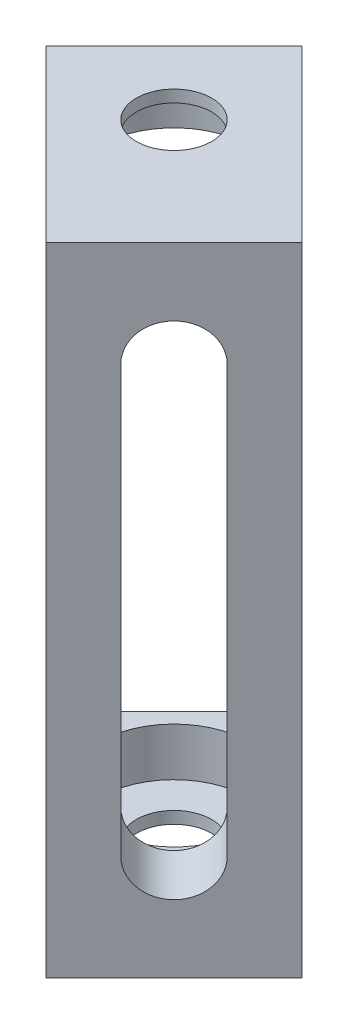
ISO-10303-21;
HEADER;
FILE_DESCRIPTION(('STEP AP214'),'2;1');
FILE_NAME('part.step','',(''),(''),'','','');
FILE_SCHEMA(('AUTOMOTIVE_DESIGN { 1 0 10303 214 1 1 1 1 }'));
ENDSEC;
DATA;
#1=APPLICATION_CONTEXT('core data for automotive mechanical design processes');
#2=APPLICATION_PROTOCOL_DEFINITION('international standard','automotive_design',2000,#1);
#3=PRODUCT_CONTEXT('',#1,'mechanical');
#4=PRODUCT('Part','Part','',(#3));
#5=PRODUCT_RELATED_PRODUCT_CATEGORY('part','',(#4));
#6=PRODUCT_DEFINITION_FORMATION('','',#4);
#7=PRODUCT_DEFINITION_CONTEXT('part definition',#1,'design');
#8=PRODUCT_DEFINITION('design','',#6,#7);
#9=PRODUCT_DEFINITION_SHAPE('','',#8);
#10=(LENGTH_UNIT() NAMED_UNIT(*) SI_UNIT(.MILLI.,.METRE.));
#11=(NAMED_UNIT(*) PLANE_ANGLE_UNIT() SI_UNIT($,.RADIAN.));
#12=(NAMED_UNIT(*) SI_UNIT($,.STERADIAN.) SOLID_ANGLE_UNIT());
#13=UNCERTAINTY_MEASURE_WITH_UNIT(LENGTH_MEASURE(1.E-05),#10,'distance_accuracy_value','');
#14=(GEOMETRIC_REPRESENTATION_CONTEXT(3) GLOBAL_UNCERTAINTY_ASSIGNED_CONTEXT((#13)) GLOBAL_UNIT_ASSIGNED_CONTEXT((#10,
#11,#12)) REPRESENTATION_CONTEXT('',''));
#15=CARTESIAN_POINT('',(0.,0.,0.));
#16=DIRECTION('',(0.,0.,1.));
#17=DIRECTION('',(1.,0.,0.));
#18=AXIS2_PLACEMENT_3D('',#15,#16,#17);
#19=CARTESIAN_POINT('',(-69.5647521950416,1.79036789554588E-13,-69.564752195041));
#20=DIRECTION('',(-0.707106781186551,0.,-0.707106781186544));
#21=DIRECTION('',(-0.707106781186544,0.,0.707106781186551));
#22=AXIS2_PLACEMENT_3D('',#19,#20,#21);
#23=PLANE('',#22);
#24=CARTESIAN_POINT('',(-80.7580787532979,22.4091567481048,-58.3714256367845));
#25=DIRECTION('',(0.70710678118655,0.,0.707106781186545));
#26=DIRECTION('',(0.707106781186545,0.,-0.70710678118655));
#27=AXIS2_PLACEMENT_3D('',#24,#25,#26);
#28=CIRCLE('',#27,1.5875);
#29=CARTESIAN_POINT('',(-79.6355467381643,22.4091567481048,-59.4939576519182));
#30=VERTEX_POINT('',#29);
#31=CARTESIAN_POINT('',(-81.8806107684316,22.4091567481048,-57.2488936216509));
#32=VERTEX_POINT('',#31);
#33=EDGE_CURVE('E211',#30,#32,#28,.T.);
#34=ORIENTED_EDGE('',*,*,#33,.T.);
#35=DIRECTION('',(0.,-1.,0.));
#36=VECTOR('',#35,1.);
#37=CARTESIAN_POINT('',(-81.8806107684316,22.4091567481048,-57.2488936216509));
#38=LINE('',#37,#36);
#39=CARTESIAN_POINT('',(-81.8806107684316,4.44499999999941,-57.2488936216509));
#40=VERTEX_POINT('',#39);
#41=EDGE_CURVE('E214',#32,#40,#38,.T.);
#42=ORIENTED_EDGE('',*,*,#41,.T.);
#43=CARTESIAN_POINT('',(-80.758078753298,4.44499999999942,-58.3714256367845));
#44=DIRECTION('',(0.70710678118655,0.,0.707106781186545));
#45=DIRECTION('',(0.707106781186545,0.,-0.70710678118655));
#46=AXIS2_PLACEMENT_3D('',#43,#44,#45);
#47=CIRCLE('',#46,1.5875);
#48=CARTESIAN_POINT('',(-79.6355467381643,4.44499999999942,-59.4939576519182));
#49=VERTEX_POINT('',#48);
#50=EDGE_CURVE('E55',#40,#49,#47,.T.);
#51=ORIENTED_EDGE('',*,*,#50,.T.);
#52=DIRECTION('',(0.,1.,0.));
#53=VECTOR('',#52,1.);
#54=CARTESIAN_POINT('',(-79.6355467381643,22.4091567481048,-59.4939576519182));
#55=LINE('',#54,#53);
#56=EDGE_CURVE('E219',#49,#30,#55,.T.);
#57=ORIENTED_EDGE('',*,*,#56,.T.);
#58=EDGE_LOOP('',(#34,#42,#51,#57));
#59=FACE_BOUND('',#58,.T.);
#60=DIRECTION('',(0.,1.,0.));
#61=VECTOR('',#60,1.);
#62=CARTESIAN_POINT('',(-78.0640019169772,-5.77204021468408E-13,-61.0655024731053));
#63=LINE('',#62,#61);
#64=CARTESIAN_POINT('',(-78.0640019169774,2.53999999999945,-61.0655024731051));
#65=VERTEX_POINT('',#64);
#66=CARTESIAN_POINT('',(-78.0640019169772,24.3141567481049,-61.0655024731052));
#67=VERTEX_POINT('',#66);
#68=EDGE_CURVE('E147',#65,#67,#63,.T.);
#69=ORIENTED_EDGE('',*,*,#68,.F.);
#70=DIRECTION('',(0.707106781186544,0.,-0.707106781186551));
#71=VECTOR('',#70,1.);
#72=CARTESIAN_POINT('',(-78.0640019169774,2.53999999999945,-61.0655024731051));
#73=LINE('',#72,#71);
#74=CARTESIAN_POINT('',(-83.4521555896189,2.53999999999946,-55.6773488004636));
#75=VERTEX_POINT('',#74);
#76=EDGE_CURVE('E128',#75,#65,#73,.T.);
#77=ORIENTED_EDGE('',*,*,#76,.F.);
#78=DIRECTION('',(0.,-1.,0.));
#79=VECTOR('',#78,1.);
#80=CARTESIAN_POINT('',(-83.4521555896187,-5.8208514288112E-13,-55.6773488004638));
#81=LINE('',#80,#79);
#82=CARTESIAN_POINT('',(-83.4521555896187,24.3141567481049,-55.6773488004637));
#83=VERTEX_POINT('',#82);
#84=EDGE_CURVE('E153',#83,#75,#81,.T.);
#85=ORIENTED_EDGE('',*,*,#84,.F.);
#86=DIRECTION('',(-0.707106781186544,0.,0.707106781186551));
#87=VECTOR('',#86,1.);
#88=CARTESIAN_POINT('',(-78.0640019169772,24.3141567481049,-61.0655024731052));
#89=LINE('',#88,#87);
#90=EDGE_CURVE('E140',#67,#83,#89,.T.);
#91=ORIENTED_EDGE('',*,*,#90,.F.);
#92=EDGE_LOOP('',(#69,#77,#85,#91));
#93=FACE_BOUND('',#92,.T.);
#94=ADVANCED_FACE('F38',(#59,#93),#23,.T.);
#95=CARTESIAN_POINT('',(-83.4521555896187,-5.8208514288112E-13,-55.6773488004638));
#96=DIRECTION('',(-0.707106781186545,0.,0.70710678118655));
#97=DIRECTION('',(0.70710678118655,0.,0.707106781186545));
#98=AXIS2_PLACEMENT_3D('',#95,#96,#97);
#99=PLANE('',#98);
#100=DIRECTION('',(0.,-1.,0.));
#101=VECTOR('',#100,1.);
#102=CARTESIAN_POINT('',(-81.6561043654049,-5.86013166052507E-13,-53.88129757625));
#103=LINE('',#102,#101);
#104=CARTESIAN_POINT('',(-81.6561043654048,26.8541567481048,-53.8812975762499));
#105=VERTEX_POINT('',#104);
#106=CARTESIAN_POINT('',(-81.6561043654049,-5.86013166052507E-13,-53.88129757625));
#107=VERTEX_POINT('',#106);
#108=EDGE_CURVE('E160',#105,#107,#103,.T.);
#109=ORIENTED_EDGE('',*,*,#108,.F.);
#110=DIRECTION('',(0.70710678118655,0.,0.707106781186545));
#111=VECTOR('',#110,1.);
#112=CARTESIAN_POINT('',(-83.4521555896187,26.8541567481048,-55.6773488004638));
#113=LINE('',#112,#111);
#114=CARTESIAN_POINT('',(-88.8403092622602,26.8541567481049,-61.0655024731052));
#115=VERTEX_POINT('',#114);
#116=EDGE_CURVE('E11',#115,#105,#113,.T.);
#117=ORIENTED_EDGE('',*,*,#116,.F.);
#118=DIRECTION('',(0.,1.,0.));
#119=VECTOR('',#118,1.);
#120=CARTESIAN_POINT('',(-88.8403092622602,26.8541567481049,-61.0655024731052));
#121=LINE('',#120,#119);
#122=CARTESIAN_POINT('',(-88.8403092622602,24.3141567481049,-61.0655024731052));
#123=VERTEX_POINT('',#122);
#124=EDGE_CURVE('E200',#123,#115,#121,.T.);
#125=ORIENTED_EDGE('',*,*,#124,.F.);
#126=DIRECTION('',(0.707106781186551,0.,0.707106781186544));
#127=VECTOR('',#126,1.);
#128=CARTESIAN_POINT('',(-88.8403092622602,24.3141567481049,-61.0655024731052));
#129=LINE('',#128,#127);
#130=EDGE_CURVE('E205',#123,#83,#129,.T.);
#131=ORIENTED_EDGE('',*,*,#130,.T.);
#132=ORIENTED_EDGE('',*,*,#84,.T.);
#133=DIRECTION('',(0.707106781186551,0.,0.707106781186544));
#134=VECTOR('',#133,1.);
#135=CARTESIAN_POINT('',(-88.8403092622604,2.53999999999947,-61.0655024731051));
#136=LINE('',#135,#134);
#137=CARTESIAN_POINT('',(-88.8403092622604,2.53999999999947,-61.0655024731051));
#138=VERTEX_POINT('',#137);
#139=EDGE_CURVE('E135',#138,#75,#136,.T.);
#140=ORIENTED_EDGE('',*,*,#139,.F.);
#141=DIRECTION('',(0.,1.,0.));
#142=VECTOR('',#141,1.);
#143=CARTESIAN_POINT('',(-88.8403092622604,-5.24110931639945E-13,-61.0655024731051));
#144=LINE('',#143,#142);
#145=CARTESIAN_POINT('',(-88.8403092622604,-5.24110931639945E-13,-61.0655024731051));
#146=VERTEX_POINT('',#145);
#147=EDGE_CURVE('E187',#146,#138,#144,.T.);
#148=ORIENTED_EDGE('',*,*,#147,.F.);
#149=DIRECTION('',(0.70710678118655,0.,0.707106781186545));
#150=VECTOR('',#149,1.);
#151=CARTESIAN_POINT('',(-83.4521555896187,-5.8208514288112E-13,-55.6773488004638));
#152=LINE('',#151,#150);
#153=EDGE_CURVE('E42',#146,#107,#152,.T.);
#154=ORIENTED_EDGE('',*,*,#153,.T.);
#155=EDGE_LOOP('',(#109,#117,#125,#131,#132,#140,#148,#154));
#156=FACE_BOUND('',#155,.T.);
#157=ADVANCED_FACE('F40',(#156),#99,.T.);
#158=CARTESIAN_POINT('',(-83.4521555896187,26.8541567481048,-55.6773488004638));
#159=DIRECTION('',(0.,1.,0.));
#160=DIRECTION('',(0.,0.,1.));
#161=AXIS2_PLACEMENT_3D('',#158,#159,#160);
#162=PLANE('',#161);
#163=CARTESIAN_POINT('',(-83.4521555896187,26.8541567481049,-61.0655024731052));
#164=DIRECTION('',(0.,-1.,0.));
#165=DIRECTION('',(0.,0.,-1.));
#166=AXIS2_PLACEMENT_3D('',#163,#164,#165);
#167=CIRCLE('',#166,1.58750000000001);
#168=CARTESIAN_POINT('',(-83.4521555896187,26.8541567481049,-62.6530024731052));
#169=VERTEX_POINT('',#168);
#170=EDGE_CURVE('E295',#169,#169,#167,.T.);
#171=ORIENTED_EDGE('',*,*,#170,.T.);
#172=EDGE_LOOP('',(#171));
#173=FACE_BOUND('',#172,.T.);
#174=DIRECTION('',(-0.707106781186544,0.,0.707106781186551));
#175=VECTOR('',#174,1.);
#176=CARTESIAN_POINT('',(-81.6561043654048,26.8541567481048,-53.8812975762499));
#177=LINE('',#176,#175);
#178=CARTESIAN_POINT('',(-76.2679506927634,26.8541567481048,-59.2694512488914));
#179=VERTEX_POINT('',#178);
#180=EDGE_CURVE('E156',#179,#105,#177,.T.);
#181=ORIENTED_EDGE('',*,*,#180,.F.);
#182=DIRECTION('',(0.70710678118655,0.,0.707106781186545));
#183=VECTOR('',#182,1.);
#184=CARTESIAN_POINT('',(-78.0640019169772,26.8541567481048,-61.0655024731053));
#185=LINE('',#184,#183);
#186=CARTESIAN_POINT('',(-83.4521555896187,26.8541567481049,-66.4536561457467));
#187=VERTEX_POINT('',#186);
#188=EDGE_CURVE('E47',#187,#179,#185,.T.);
#189=ORIENTED_EDGE('',*,*,#188,.F.);
#190=DIRECTION('',(0.707106781186545,0.,-0.70710678118655));
#191=VECTOR('',#190,1.);
#192=CARTESIAN_POINT('',(-83.4521555896187,26.8541567481049,-66.4536561457467));
#193=LINE('',#192,#191);
#194=EDGE_CURVE('E202',#115,#187,#193,.T.);
#195=ORIENTED_EDGE('',*,*,#194,.F.);
#196=ORIENTED_EDGE('',*,*,#116,.T.);
#197=EDGE_LOOP('',(#181,#189,#195,#196));
#198=FACE_BOUND('',#197,.T.);
#199=ADVANCED_FACE('F264',(#173,#198),#162,.T.);
#200=CARTESIAN_POINT('',(-78.0640019169772,-5.77204021468408E-13,-61.0655024731053));
#201=DIRECTION('',(0.707106781186545,0.,-0.70710678118655));
#202=DIRECTION('',(-0.70710678118655,0.,-0.707106781186545));
#203=AXIS2_PLACEMENT_3D('',#200,#201,#202);
#204=PLANE('',#203);
#205=DIRECTION('',(0.,1.,0.));
#206=VECTOR('',#205,1.);
#207=CARTESIAN_POINT('',(-76.2679506927634,-5.81132044639795E-13,-59.2694512488915));
#208=LINE('',#207,#206);
#209=CARTESIAN_POINT('',(-76.2679506927634,-5.81132044639795E-13,-59.2694512488915));
#210=VERTEX_POINT('',#209);
#211=EDGE_CURVE('E167',#210,#179,#208,.T.);
#212=ORIENTED_EDGE('',*,*,#211,.F.);
#213=DIRECTION('',(0.70710678118655,0.,0.707106781186545));
#214=VECTOR('',#213,1.);
#215=CARTESIAN_POINT('',(-78.0640019169772,-5.77204021468408E-13,-61.0655024731053));
#216=LINE('',#215,#214);
#217=CARTESIAN_POINT('',(-83.4521555896187,-5.0753201776221E-13,-66.4536561457468));
#218=VERTEX_POINT('',#217);
#219=EDGE_CURVE('E155',#218,#210,#216,.T.);
#220=ORIENTED_EDGE('',*,*,#219,.F.);
#221=DIRECTION('',(0.,-1.,0.));
#222=VECTOR('',#221,1.);
#223=CARTESIAN_POINT('',(-83.4521555896187,-5.0753201776221E-13,-66.4536561457468));
#224=LINE('',#223,#222);
#225=CARTESIAN_POINT('',(-83.4521555896189,2.53999999999946,-66.4536561457466));
#226=VERTEX_POINT('',#225);
#227=EDGE_CURVE('E141',#226,#218,#224,.T.);
#228=ORIENTED_EDGE('',*,*,#227,.F.);
#229=DIRECTION('',(0.707106781186551,0.,0.707106781186544));
#230=VECTOR('',#229,1.);
#231=CARTESIAN_POINT('',(-83.4521555896189,2.53999999999946,-66.4536561457466));
#232=LINE('',#231,#230);
#233=EDGE_CURVE('E132',#226,#65,#232,.T.);
#234=ORIENTED_EDGE('',*,*,#233,.T.);
#235=ORIENTED_EDGE('',*,*,#68,.T.);
#236=DIRECTION('',(0.707106781186551,0.,0.707106781186544));
#237=VECTOR('',#236,1.);
#238=CARTESIAN_POINT('',(-83.4521555896187,24.3141567481049,-66.4536561457467));
#239=LINE('',#238,#237);
#240=CARTESIAN_POINT('',(-83.4521555896187,24.3141567481049,-66.4536561457467));
#241=VERTEX_POINT('',#240);
#242=EDGE_CURVE('E209',#241,#67,#239,.T.);
#243=ORIENTED_EDGE('',*,*,#242,.F.);
#244=DIRECTION('',(0.,-1.,0.));
#245=VECTOR('',#244,1.);
#246=CARTESIAN_POINT('',(-83.4521555896187,26.8541567481049,-66.4536561457467));
#247=LINE('',#246,#245);
#248=EDGE_CURVE('E195',#187,#241,#247,.T.);
#249=ORIENTED_EDGE('',*,*,#248,.F.);
#250=ORIENTED_EDGE('',*,*,#188,.T.);
#251=EDGE_LOOP('',(#212,#220,#228,#234,#235,#243,#249,#250));
#252=FACE_BOUND('',#251,.T.);
#253=ADVANCED_FACE('F145',(#252),#204,.T.);
#254=CARTESIAN_POINT('',(-83.4521555896187,-5.8208514288112E-13,-55.6773488004638));
#255=DIRECTION('',(0.,-1.,0.));
#256=DIRECTION('',(0.,0.,-1.));
#257=AXIS2_PLACEMENT_3D('',#254,#255,#256);
#258=PLANE('',#257);
#259=CARTESIAN_POINT('',(-83.4521555896189,-5.99346960949987E-13,-61.0655024731051));
#260=DIRECTION('',(0.,1.,0.));
#261=DIRECTION('',(0.,0.,1.));
#262=AXIS2_PLACEMENT_3D('',#259,#260,#261);
#263=CIRCLE('',#262,1.58750000000001);
#264=CARTESIAN_POINT('',(-83.4521555896189,-5.99672990769984E-13,-59.4780024731051));
#265=VERTEX_POINT('',#264);
#266=EDGE_CURVE('E281',#265,#265,#263,.T.);
#267=ORIENTED_EDGE('',*,*,#266,.T.);
#268=EDGE_LOOP('',(#267));
#269=FACE_BOUND('',#268,.T.);
#270=DIRECTION('',(0.707106781186545,0.,-0.70710678118655));
#271=VECTOR('',#270,1.);
#272=CARTESIAN_POINT('',(-81.6561043654049,-5.86013166052507E-13,-53.88129757625));
#273=LINE('',#272,#271);
#274=EDGE_CURVE('E163',#107,#210,#273,.T.);
#275=ORIENTED_EDGE('',*,*,#274,.F.);
#276=ORIENTED_EDGE('',*,*,#153,.F.);
#277=DIRECTION('',(-0.707106781186543,0.,0.707106781186552));
#278=VECTOR('',#277,1.);
#279=CARTESIAN_POINT('',(-83.4521555896187,-5.0753201776221E-13,-66.4536561457468));
#280=LINE('',#279,#278);
#281=EDGE_CURVE('E177',#218,#146,#280,.T.);
#282=ORIENTED_EDGE('',*,*,#281,.F.);
#283=ORIENTED_EDGE('',*,*,#219,.T.);
#284=EDGE_LOOP('',(#275,#276,#282,#283));
#285=FACE_BOUND('',#284,.T.);
#286=ADVANCED_FACE('F175',(#269,#285),#258,.T.);
#287=CARTESIAN_POINT('',(-67.7687009708278,1.75108766383202E-13,-67.7687009708272));
#288=DIRECTION('',(-0.707106781186551,0.,-0.707106781186544));
#289=DIRECTION('',(-0.707106781186544,0.,0.707106781186551));
#290=AXIS2_PLACEMENT_3D('',#287,#288,#289);
#291=PLANE('',#290);
#292=DIRECTION('',(0.,-1.,0.));
#293=VECTOR('',#292,1.);
#294=CARTESIAN_POINT('',(-80.0845595442178,22.4091567481048,-55.4528423974371));
#295=LINE('',#294,#293);
#296=CARTESIAN_POINT('',(-80.0845595442178,22.4091567481048,-55.4528423974371));
#297=VERTEX_POINT('',#296);
#298=CARTESIAN_POINT('',(-80.0845595442178,4.44499999999941,-55.4528423974371));
#299=VERTEX_POINT('',#298);
#300=EDGE_CURVE('E224',#297,#299,#295,.T.);
#301=ORIENTED_EDGE('',*,*,#300,.F.);
#302=CARTESIAN_POINT('',(-78.9620275290841,22.4091567481048,-56.5753744125707));
#303=DIRECTION('',(0.70710678118655,0.,0.707106781186545));
#304=DIRECTION('',(0.707106781186545,0.,-0.70710678118655));
#305=AXIS2_PLACEMENT_3D('',#302,#303,#304);
#306=CIRCLE('',#305,1.5875);
#307=CARTESIAN_POINT('',(-77.8394955139505,22.4091567481048,-57.6979064277043));
#308=VERTEX_POINT('',#307);
#309=EDGE_CURVE('E63',#308,#297,#306,.T.);
#310=ORIENTED_EDGE('',*,*,#309,.F.);
#311=DIRECTION('',(0.,1.,0.));
#312=VECTOR('',#311,1.);
#313=CARTESIAN_POINT('',(-77.8394955139505,22.4091567481048,-57.6979064277043));
#314=LINE('',#313,#312);
#315=CARTESIAN_POINT('',(-77.8394955139505,4.44499999999942,-57.6979064277044));
#316=VERTEX_POINT('',#315);
#317=EDGE_CURVE('E215',#316,#308,#314,.T.);
#318=ORIENTED_EDGE('',*,*,#317,.F.);
#319=CARTESIAN_POINT('',(-78.9620275290841,4.44499999999942,-56.5753744125707));
#320=DIRECTION('',(0.70710678118655,0.,0.707106781186545));
#321=DIRECTION('',(0.707106781186545,0.,-0.70710678118655));
#322=AXIS2_PLACEMENT_3D('',#319,#320,#321);
#323=CIRCLE('',#322,1.5875);
#324=EDGE_CURVE('E227',#299,#316,#323,.T.);
#325=ORIENTED_EDGE('',*,*,#324,.F.);
#326=EDGE_LOOP('',(#301,#310,#318,#325));
#327=FACE_BOUND('',#326,.T.);
#328=ORIENTED_EDGE('',*,*,#108,.T.);
#329=ORIENTED_EDGE('',*,*,#274,.T.);
#330=ORIENTED_EDGE('',*,*,#211,.T.);
#331=ORIENTED_EDGE('',*,*,#180,.T.);
#332=EDGE_LOOP('',(#328,#329,#330,#331));
#333=FACE_BOUND('',#332,.T.);
#334=ADVANCED_FACE('F181',(#327,#333),#291,.F.);
#335=CARTESIAN_POINT('',(-80.7580787532979,22.4091567481048,-58.3714256367845));
#336=DIRECTION('',(0.70710678118655,0.,0.707106781186545));
#337=DIRECTION('',(0.707106781186545,0.,-0.70710678118655));
#338=AXIS2_PLACEMENT_3D('',#335,#336,#337);
#339=CYLINDRICAL_SURFACE('',#338,1.5875);
#340=ORIENTED_EDGE('',*,*,#309,.T.);
#341=DIRECTION('',(0.70710678118655,0.,0.707106781186545));
#342=VECTOR('',#341,1.);
#343=CARTESIAN_POINT('',(-81.8806107684316,22.4091567481048,-57.2488936216509));
#344=LINE('',#343,#342);
#345=EDGE_CURVE('E222',#32,#297,#344,.T.);
#346=ORIENTED_EDGE('',*,*,#345,.F.);
#347=ORIENTED_EDGE('',*,*,#33,.F.);
#348=DIRECTION('',(0.70710678118655,0.,0.707106781186545));
#349=VECTOR('',#348,1.);
#350=CARTESIAN_POINT('',(-79.6355467381643,22.4091567481048,-59.4939576519182));
#351=LINE('',#350,#349);
#352=EDGE_CURVE('E164',#30,#308,#351,.T.);
#353=ORIENTED_EDGE('',*,*,#352,.T.);
#354=EDGE_LOOP('',(#340,#346,#347,#353));
#355=FACE_BOUND('',#354,.T.);
#356=ADVANCED_FACE('F247',(#355),#339,.F.);
#357=CARTESIAN_POINT('',(-79.6355467381643,22.4091567481048,-59.4939576519182));
#358=DIRECTION('',(0.707106781186545,0.,-0.70710678118655));
#359=DIRECTION('',(-0.70710678118655,0.,-0.707106781186545));
#360=AXIS2_PLACEMENT_3D('',#357,#358,#359);
#361=PLANE('',#360);
#362=ORIENTED_EDGE('',*,*,#317,.T.);
#363=ORIENTED_EDGE('',*,*,#352,.F.);
#364=ORIENTED_EDGE('',*,*,#56,.F.);
#365=DIRECTION('',(0.70710678118655,0.,0.707106781186545));
#366=VECTOR('',#365,1.);
#367=CARTESIAN_POINT('',(-79.6355467381643,4.44499999999942,-59.4939576519182));
#368=LINE('',#367,#366);
#369=EDGE_CURVE('E233',#49,#316,#368,.T.);
#370=ORIENTED_EDGE('',*,*,#369,.T.);
#371=EDGE_LOOP('',(#362,#363,#364,#370));
#372=FACE_BOUND('',#371,.T.);
#373=ADVANCED_FACE('F249',(#372),#361,.F.);
#374=CARTESIAN_POINT('',(-80.758078753298,4.44499999999942,-58.3714256367845));
#375=DIRECTION('',(0.70710678118655,0.,0.707106781186545));
#376=DIRECTION('',(0.707106781186545,0.,-0.70710678118655));
#377=AXIS2_PLACEMENT_3D('',#374,#375,#376);
#378=CYLINDRICAL_SURFACE('',#377,1.5875);
#379=ORIENTED_EDGE('',*,*,#324,.T.);
#380=ORIENTED_EDGE('',*,*,#369,.F.);
#381=ORIENTED_EDGE('',*,*,#50,.F.);
#382=DIRECTION('',(0.70710678118655,0.,0.707106781186545));
#383=VECTOR('',#382,1.);
#384=CARTESIAN_POINT('',(-81.8806107684316,4.44499999999942,-57.2488936216509));
#385=LINE('',#384,#383);
#386=EDGE_CURVE('E235',#40,#299,#385,.T.);
#387=ORIENTED_EDGE('',*,*,#386,.T.);
#388=EDGE_LOOP('',(#379,#380,#381,#387));
#389=FACE_BOUND('',#388,.T.);
#390=ADVANCED_FACE('F244',(#389),#378,.F.);
#391=CARTESIAN_POINT('',(-81.8806107684316,22.4091567481048,-57.2488936216509));
#392=DIRECTION('',(-0.707106781186545,0.,0.70710678118655));
#393=DIRECTION('',(0.70710678118655,0.,0.707106781186545));
#394=AXIS2_PLACEMENT_3D('',#391,#392,#393);
#395=PLANE('',#394);
#396=ORIENTED_EDGE('',*,*,#300,.T.);
#397=ORIENTED_EDGE('',*,*,#386,.F.);
#398=ORIENTED_EDGE('',*,*,#41,.F.);
#399=ORIENTED_EDGE('',*,*,#345,.T.);
#400=EDGE_LOOP('',(#396,#397,#398,#399));
#401=FACE_BOUND('',#400,.T.);
#402=ADVANCED_FACE('F239',(#401),#395,.F.);
#403=CARTESIAN_POINT('',(-83.4521555896187,24.3141567481049,-66.4536561457467));
#404=DIRECTION('',(0.,1.,0.));
#405=DIRECTION('',(-1.,0.,0.));
#406=AXIS2_PLACEMENT_3D('',#403,#404,#405);
#407=PLANE('',#406);
#408=CARTESIAN_POINT('',(-83.4521555896187,24.3141567481049,-61.0655024731052));
#409=DIRECTION('',(0.,-1.,0.));
#410=DIRECTION('',(0.,0.,-1.));
#411=AXIS2_PLACEMENT_3D('',#408,#409,#410);
#412=CIRCLE('',#411,3.175);
#413=CARTESIAN_POINT('',(-83.4521555896187,24.3141567481049,-64.2405024731052));
#414=VERTEX_POINT('',#413);
#415=EDGE_CURVE('E304',#414,#414,#412,.T.);
#416=ORIENTED_EDGE('',*,*,#415,.F.);
#417=EDGE_LOOP('',(#416));
#418=FACE_BOUND('',#417,.T.);
#419=ORIENTED_EDGE('',*,*,#90,.T.);
#420=ORIENTED_EDGE('',*,*,#130,.F.);
#421=DIRECTION('',(-0.707106781186544,0.,0.707106781186551));
#422=VECTOR('',#421,1.);
#423=CARTESIAN_POINT('',(-83.4521555896187,24.3141567481049,-66.4536561457467));
#424=LINE('',#423,#422);
#425=EDGE_CURVE('E198',#241,#123,#424,.T.);
#426=ORIENTED_EDGE('',*,*,#425,.F.);
#427=ORIENTED_EDGE('',*,*,#242,.T.);
#428=EDGE_LOOP('',(#419,#420,#426,#427));
#429=FACE_BOUND('',#428,.T.);
#430=ADVANCED_FACE('F310',(#418,#429),#407,.F.);
#431=CARTESIAN_POINT('',(-74.9529058676832,3.94003204697649E-13,-74.9529058676825));
#432=DIRECTION('',(-0.707106781186551,0.,-0.707106781186544));
#433=DIRECTION('',(-0.707106781186544,0.,0.707106781186551));
#434=AXIS2_PLACEMENT_3D('',#431,#432,#433);
#435=PLANE('',#434);
#436=ORIENTED_EDGE('',*,*,#248,.T.);
#437=ORIENTED_EDGE('',*,*,#425,.T.);
#438=ORIENTED_EDGE('',*,*,#124,.T.);
#439=ORIENTED_EDGE('',*,*,#194,.T.);
#440=EDGE_LOOP('',(#436,#437,#438,#439));
#441=FACE_BOUND('',#440,.T.);
#442=ADVANCED_FACE('F313',(#441),#435,.T.);
#443=CARTESIAN_POINT('',(-83.4521555896189,2.53999999999946,-66.4536561457466));
#444=DIRECTION('',(0.,-1.,0.));
#445=DIRECTION('',(1.,0.,0.));
#446=AXIS2_PLACEMENT_3D('',#443,#444,#445);
#447=PLANE('',#446);
#448=CARTESIAN_POINT('',(-83.4521555896189,2.53999999999946,-61.0655024731051));
#449=DIRECTION('',(0.,1.,0.));
#450=DIRECTION('',(0.,0.,1.));
#451=AXIS2_PLACEMENT_3D('',#448,#449,#450);
#452=CIRCLE('',#451,3.175);
#453=CARTESIAN_POINT('',(-83.4521555896189,2.53999999999946,-57.8905024731051));
#454=VERTEX_POINT('',#453);
#455=EDGE_CURVE('E292',#454,#454,#452,.T.);
#456=ORIENTED_EDGE('',*,*,#455,.F.);
#457=EDGE_LOOP('',(#456));
#458=FACE_BOUND('',#457,.T.);
#459=ORIENTED_EDGE('',*,*,#76,.T.);
#460=ORIENTED_EDGE('',*,*,#233,.F.);
#461=DIRECTION('',(0.707106781186544,0.,-0.707106781186551));
#462=VECTOR('',#461,1.);
#463=CARTESIAN_POINT('',(-83.4521555896189,2.53999999999946,-66.4536561457466));
#464=LINE('',#463,#462);
#465=EDGE_CURVE('E150',#138,#226,#464,.T.);
#466=ORIENTED_EDGE('',*,*,#465,.F.);
#467=ORIENTED_EDGE('',*,*,#139,.T.);
#468=EDGE_LOOP('',(#459,#460,#466,#467));
#469=FACE_BOUND('',#468,.T.);
#470=ADVANCED_FACE('F130',(#458,#469),#447,.F.);
#471=CARTESIAN_POINT('',(-74.9529058676831,3.94003204697598E-13,-74.9529058676825));
#472=DIRECTION('',(0.707106781186551,0.,0.707106781186544));
#473=DIRECTION('',(0.707106781186544,0.,-0.707106781186551));
#474=AXIS2_PLACEMENT_3D('',#471,#472,#473);
#475=PLANE('',#474);
#476=ORIENTED_EDGE('',*,*,#227,.T.);
#477=ORIENTED_EDGE('',*,*,#281,.T.);
#478=ORIENTED_EDGE('',*,*,#147,.T.);
#479=ORIENTED_EDGE('',*,*,#465,.T.);
#480=EDGE_LOOP('',(#476,#477,#478,#479));
#481=FACE_BOUND('',#480,.T.);
#482=ADVANCED_FACE('F189',(#481),#475,.F.);
#483=CARTESIAN_POINT('',(-83.4521555896189,2.53999999999946,-61.0655024731051));
#484=DIRECTION('',(0.,1.,0.));
#485=DIRECTION('',(0.,0.,1.));
#486=AXIS2_PLACEMENT_3D('',#483,#484,#485);
#487=CYLINDRICAL_SURFACE('',#486,1.58750000000001);
#488=ORIENTED_EDGE('',*,*,#266,.F.);
#489=EDGE_LOOP('',(#488));
#490=FACE_BOUND('',#489,.T.);
#491=CARTESIAN_POINT('',(-83.4521555896189,0.507999999999463,-61.0655024731051));
#492=DIRECTION('',(0.,1.,0.));
#493=DIRECTION('',(0.,0.,1.));
#494=AXIS2_PLACEMENT_3D('',#491,#492,#493);
#495=CIRCLE('',#494,1.58750000000002);
#496=CARTESIAN_POINT('',(-83.4521555896189,0.507999999999463,-59.4780024731051));
#497=VERTEX_POINT('',#496);
#498=EDGE_CURVE('E283',#497,#497,#495,.T.);
#499=ORIENTED_EDGE('',*,*,#498,.T.);
#500=EDGE_LOOP('',(#499));
#501=FACE_BOUND('',#500,.T.);
#502=ADVANCED_FACE('F328',(#490,#501),#487,.F.);
#503=CARTESIAN_POINT('',(-81.8646555896189,0.507999999999463,-61.0655024731051));
#504=DIRECTION('',(0.,-1.,0.));
#505=DIRECTION('',(0.,0.,-1.));
#506=AXIS2_PLACEMENT_3D('',#503,#504,#505);
#507=PLANE('',#506);
#508=ORIENTED_EDGE('',*,*,#498,.F.);
#509=EDGE_LOOP('',(#508));
#510=FACE_BOUND('',#509,.T.);
#511=CARTESIAN_POINT('',(-83.4521555896189,0.507999999999463,-61.0655024731051));
#512=DIRECTION('',(0.,1.,0.));
#513=DIRECTION('',(0.,0.,1.));
#514=AXIS2_PLACEMENT_3D('',#511,#512,#513);
#515=CIRCLE('',#514,3.175);
#516=CARTESIAN_POINT('',(-83.4521555896189,0.507999999999462,-57.8905024731051));
#517=VERTEX_POINT('',#516);
#518=EDGE_CURVE('E287',#517,#517,#515,.T.);
#519=ORIENTED_EDGE('',*,*,#518,.T.);
#520=EDGE_LOOP('',(#519));
#521=FACE_BOUND('',#520,.T.);
#522=ADVANCED_FACE('F332',(#510,#521),#507,.F.);
#523=CARTESIAN_POINT('',(-83.4521555896189,2.53999999999946,-61.0655024731051));
#524=DIRECTION('',(0.,1.,0.));
#525=DIRECTION('',(0.,0.,1.));
#526=AXIS2_PLACEMENT_3D('',#523,#524,#525);
#527=CYLINDRICAL_SURFACE('',#526,3.175);
#528=ORIENTED_EDGE('',*,*,#518,.F.);
#529=EDGE_LOOP('',(#528));
#530=FACE_BOUND('',#529,.T.);
#531=ORIENTED_EDGE('',*,*,#455,.T.);
#532=EDGE_LOOP('',(#531));
#533=FACE_BOUND('',#532,.T.);
#534=ADVANCED_FACE('F335',(#530,#533),#527,.F.);
#535=CARTESIAN_POINT('',(-83.4521555896187,24.3141567481049,-61.0655024731052));
#536=DIRECTION('',(0.,-1.,0.));
#537=DIRECTION('',(0.,0.,-1.));
#538=AXIS2_PLACEMENT_3D('',#535,#536,#537);
#539=CYLINDRICAL_SURFACE('',#538,1.58750000000001);
#540=ORIENTED_EDGE('',*,*,#170,.F.);
#541=EDGE_LOOP('',(#540));
#542=FACE_BOUND('',#541,.T.);
#543=CARTESIAN_POINT('',(-83.4521555896187,26.3461567481049,-61.0655024731052));
#544=DIRECTION('',(0.,-1.,0.));
#545=DIRECTION('',(0.,0.,-1.));
#546=AXIS2_PLACEMENT_3D('',#543,#544,#545);
#547=CIRCLE('',#546,1.58750000000002);
#548=CARTESIAN_POINT('',(-83.4521555896187,26.3461567481049,-62.6530024731052));
#549=VERTEX_POINT('',#548);
#550=EDGE_CURVE('E298',#549,#549,#547,.T.);
#551=ORIENTED_EDGE('',*,*,#550,.T.);
#552=EDGE_LOOP('',(#551));
#553=FACE_BOUND('',#552,.T.);
#554=ADVANCED_FACE('F339',(#542,#553),#539,.F.);
#555=CARTESIAN_POINT('',(-81.8646555896187,26.3461567481049,-61.0655024731052));
#556=DIRECTION('',(0.,1.,0.));
#557=DIRECTION('',(0.,0.,1.));
#558=AXIS2_PLACEMENT_3D('',#555,#556,#557);
#559=PLANE('',#558);
#560=ORIENTED_EDGE('',*,*,#550,.F.);
#561=EDGE_LOOP('',(#560));
#562=FACE_BOUND('',#561,.T.);
#563=CARTESIAN_POINT('',(-83.4521555896187,26.3461567481049,-61.0655024731052));
#564=DIRECTION('',(0.,-1.,0.));
#565=DIRECTION('',(0.,0.,-1.));
#566=AXIS2_PLACEMENT_3D('',#563,#564,#565);
#567=CIRCLE('',#566,3.175);
#568=CARTESIAN_POINT('',(-83.4521555896187,26.3461567481049,-64.2405024731052));
#569=VERTEX_POINT('',#568);
#570=EDGE_CURVE('E301',#569,#569,#567,.T.);
#571=ORIENTED_EDGE('',*,*,#570,.T.);
#572=EDGE_LOOP('',(#571));
#573=FACE_BOUND('',#572,.T.);
#574=ADVANCED_FACE('F343',(#562,#573),#559,.F.);
#575=CARTESIAN_POINT('',(-83.4521555896187,24.3141567481049,-61.0655024731052));
#576=DIRECTION('',(0.,-1.,0.));
#577=DIRECTION('',(0.,0.,-1.));
#578=AXIS2_PLACEMENT_3D('',#575,#576,#577);
#579=CYLINDRICAL_SURFACE('',#578,3.175);
#580=ORIENTED_EDGE('',*,*,#570,.F.);
#581=EDGE_LOOP('',(#580));
#582=FACE_BOUND('',#581,.T.);
#583=ORIENTED_EDGE('',*,*,#415,.T.);
#584=EDGE_LOOP('',(#583));
#585=FACE_BOUND('',#584,.T.);
#586=ADVANCED_FACE('F308',(#582,#585),#579,.F.);
#587=CLOSED_SHELL('',(#94,#157,#199,#253,#286,#334,#356,#373,#390,#402,#430,#442,#470,#482,#502,
#522,#534,#554,#574,#586));
#588=MANIFOLD_SOLID_BREP('B2',#587);
#589=ADVANCED_BREP_SHAPE_REPRESENTATION('',(#18,#588),#14);
#590=SHAPE_DEFINITION_REPRESENTATION(#9,#589);
ENDSEC;
END-ISO-10303-21;
